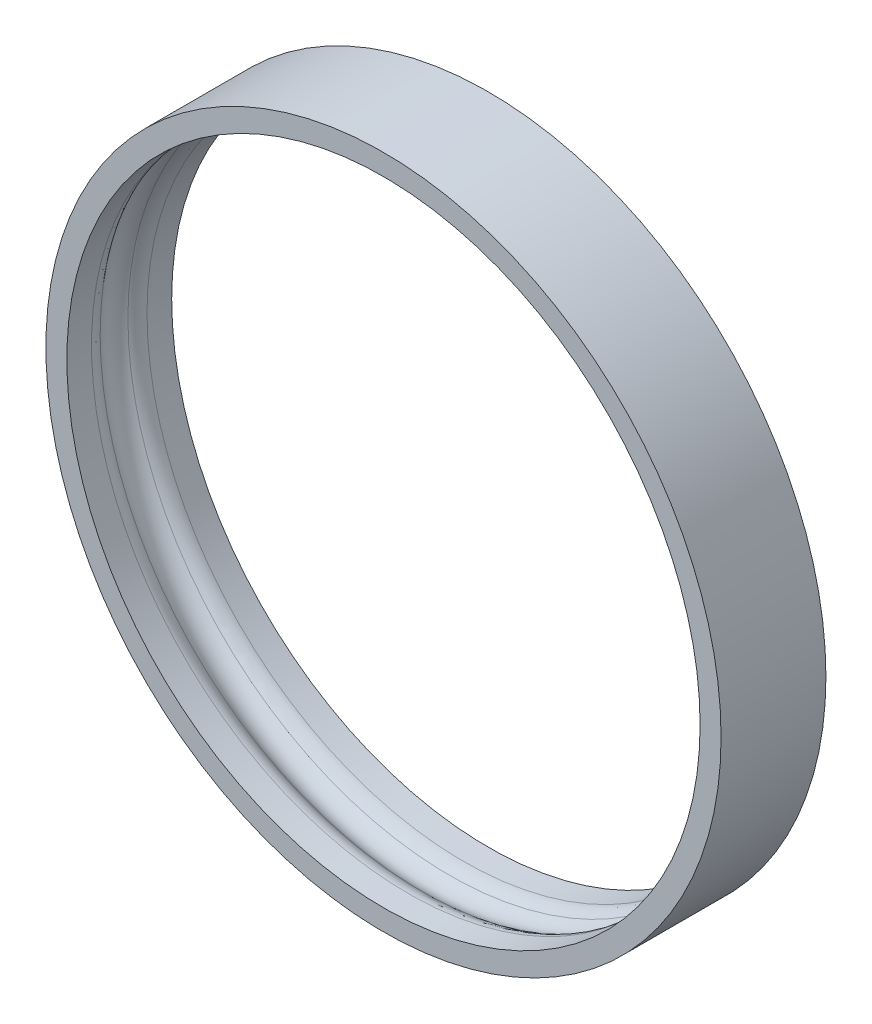
ISO-10303-21;
HEADER;
FILE_DESCRIPTION(('STEP AP214'),'2;1');
FILE_NAME('part.step','',(''),(''),'','','');
FILE_SCHEMA(('AUTOMOTIVE_DESIGN { 1 0 10303 214 1 1 1 1 }'));
ENDSEC;
DATA;
#1=APPLICATION_CONTEXT('core data for automotive mechanical design processes');
#2=APPLICATION_PROTOCOL_DEFINITION('international standard','automotive_design',2000,#1);
#3=PRODUCT_CONTEXT('',#1,'mechanical');
#4=PRODUCT('Part','Part','',(#3));
#5=PRODUCT_RELATED_PRODUCT_CATEGORY('part','',(#4));
#6=PRODUCT_DEFINITION_FORMATION('','',#4);
#7=PRODUCT_DEFINITION_CONTEXT('part definition',#1,'design');
#8=PRODUCT_DEFINITION('design','',#6,#7);
#9=PRODUCT_DEFINITION_SHAPE('','',#8);
#10=(LENGTH_UNIT() NAMED_UNIT(*) SI_UNIT(.MILLI.,.METRE.));
#11=(NAMED_UNIT(*) PLANE_ANGLE_UNIT() SI_UNIT($,.RADIAN.));
#12=(NAMED_UNIT(*) SI_UNIT($,.STERADIAN.) SOLID_ANGLE_UNIT());
#13=UNCERTAINTY_MEASURE_WITH_UNIT(LENGTH_MEASURE(1.E-05),#10,'distance_accuracy_value','');
#14=(GEOMETRIC_REPRESENTATION_CONTEXT(3) GLOBAL_UNCERTAINTY_ASSIGNED_CONTEXT((#13)) GLOBAL_UNIT_ASSIGNED_CONTEXT((#10,
#11,#12)) REPRESENTATION_CONTEXT('',''));
#15=CARTESIAN_POINT('',(0.,0.,0.));
#16=DIRECTION('',(0.,0.,1.));
#17=DIRECTION('',(1.,0.,0.));
#18=AXIS2_PLACEMENT_3D('',#15,#16,#17);
#19=CARTESIAN_POINT('',(0.,0.,2.5));
#20=DIRECTION('',(0.,0.,-1.));
#21=DIRECTION('',(-1.,0.,0.));
#22=AXIS2_PLACEMENT_3D('',#19,#20,#21);
#23=CYLINDRICAL_SURFACE('',#22,15.1);
#24=CARTESIAN_POINT('',(0.,0.,1.32287565553229));
#25=DIRECTION('',(0.,0.,1.));
#26=DIRECTION('',(1.,0.,0.));
#27=AXIS2_PLACEMENT_3D('',#24,#25,#26);
#28=CIRCLE('',#27,15.1);
#29=CARTESIAN_POINT('',(15.1,0.,1.32287565553229));
#30=VERTEX_POINT('',#29);
#31=EDGE_CURVE('E51',#30,#30,#28,.F.);
#32=ORIENTED_EDGE('',*,*,#31,.T.);
#33=EDGE_LOOP('',(#32));
#34=FACE_BOUND('',#33,.T.);
#35=CARTESIAN_POINT('',(0.,0.,2.5));
#36=DIRECTION('',(0.,0.,1.));
#37=DIRECTION('',(1.,0.,0.));
#38=AXIS2_PLACEMENT_3D('',#35,#36,#37);
#39=CIRCLE('',#38,15.1);
#40=CARTESIAN_POINT('',(15.1,0.,2.5));
#41=VERTEX_POINT('',#40);
#42=EDGE_CURVE('E60',#41,#41,#39,.T.);
#43=ORIENTED_EDGE('',*,*,#42,.T.);
#44=EDGE_LOOP('',(#43));
#45=FACE_BOUND('',#44,.T.);
#46=ADVANCED_FACE('F36',(#34,#45),#23,.F.);
#47=CARTESIAN_POINT('',(0.,0.,-1.32287565553229));
#48=DIRECTION('',(0.,0.,-1.));
#49=DIRECTION('',(-1.,0.,0.));
#50=AXIS2_PLACEMENT_3D('',#47,#48,#49);
#51=CIRCLE('',#50,15.1);
#52=CARTESIAN_POINT('',(-15.1,0.,-1.32287565553229));
#53=VERTEX_POINT('',#52);
#54=EDGE_CURVE('E10',#53,#53,#51,.F.);
#55=ORIENTED_EDGE('',*,*,#54,.T.);
#56=EDGE_LOOP('',(#55));
#57=FACE_BOUND('',#56,.T.);
#58=CARTESIAN_POINT('',(0.,0.,-2.5));
#59=DIRECTION('',(0.,0.,1.));
#60=DIRECTION('',(1.,0.,0.));
#61=AXIS2_PLACEMENT_3D('',#58,#59,#60);
#62=CIRCLE('',#61,15.1);
#63=CARTESIAN_POINT('',(15.1,0.,-2.5));
#64=VERTEX_POINT('',#63);
#65=EDGE_CURVE('E63',#64,#64,#62,.T.);
#66=ORIENTED_EDGE('',*,*,#65,.F.);
#67=EDGE_LOOP('',(#66));
#68=FACE_BOUND('',#67,.T.);
#69=ADVANCED_FACE('F73',(#57,#68),#23,.F.);
#70=CARTESIAN_POINT('',(0.,0.,2.5));
#71=DIRECTION('',(0.,0.,1.));
#72=DIRECTION('',(1.,0.,0.));
#73=AXIS2_PLACEMENT_3D('',#70,#71,#72);
#74=PLANE('',#73);
#75=CARTESIAN_POINT('',(0.,0.,2.5));
#76=DIRECTION('',(0.,0.,1.));
#77=DIRECTION('',(1.,0.,0.));
#78=AXIS2_PLACEMENT_3D('',#75,#76,#77);
#79=CIRCLE('',#78,16.1);
#80=CARTESIAN_POINT('',(16.1,0.,2.5));
#81=VERTEX_POINT('',#80);
#82=EDGE_CURVE('E56',#81,#81,#79,.T.);
#83=ORIENTED_EDGE('',*,*,#82,.T.);
#84=EDGE_LOOP('',(#83));
#85=FACE_BOUND('',#84,.T.);
#86=ORIENTED_EDGE('',*,*,#42,.F.);
#87=EDGE_LOOP('',(#86));
#88=FACE_BOUND('',#87,.T.);
#89=ADVANCED_FACE('F70',(#85,#88),#74,.T.);
#90=CARTESIAN_POINT('',(0.,0.,-2.5));
#91=DIRECTION('',(0.,0.,1.));
#92=DIRECTION('',(1.,0.,0.));
#93=AXIS2_PLACEMENT_3D('',#90,#91,#92);
#94=PLANE('',#93);
#95=CARTESIAN_POINT('',(0.,0.,-2.5));
#96=DIRECTION('',(0.,0.,1.));
#97=DIRECTION('',(1.,0.,0.));
#98=AXIS2_PLACEMENT_3D('',#95,#96,#97);
#99=CIRCLE('',#98,16.1);
#100=CARTESIAN_POINT('',(16.1,0.,-2.5));
#101=VERTEX_POINT('',#100);
#102=EDGE_CURVE('E57',#101,#101,#99,.T.);
#103=ORIENTED_EDGE('',*,*,#102,.F.);
#104=EDGE_LOOP('',(#103));
#105=FACE_BOUND('',#104,.T.);
#106=ORIENTED_EDGE('',*,*,#65,.T.);
#107=EDGE_LOOP('',(#106));
#108=FACE_BOUND('',#107,.T.);
#109=ADVANCED_FACE('F72',(#105,#108),#94,.F.);
#110=CARTESIAN_POINT('',(0.,0.,2.5));
#111=DIRECTION('',(0.,0.,-1.));
#112=DIRECTION('',(-1.,0.,0.));
#113=AXIS2_PLACEMENT_3D('',#110,#111,#112);
#114=CYLINDRICAL_SURFACE('',#113,16.1);
#115=ORIENTED_EDGE('',*,*,#82,.F.);
#116=EDGE_LOOP('',(#115));
#117=FACE_BOUND('',#116,.T.);
#118=ORIENTED_EDGE('',*,*,#102,.T.);
#119=EDGE_LOOP('',(#118));
#120=FACE_BOUND('',#119,.T.);
#121=ADVANCED_FACE('F80',(#117,#120),#114,.T.);
#122=CARTESIAN_POINT('',(0.,0.,0.));
#123=DIRECTION('',(0.,0.,1.));
#124=DIRECTION('',(1.,0.,0.));
#125=AXIS2_PLACEMENT_3D('',#122,#123,#124);
#126=TOROIDAL_SURFACE('',#125,14.6,1.);
#127=CARTESIAN_POINT('',(0.,0.,0.661437827766145));
#128=DIRECTION('',(0.,0.,-1.));
#129=DIRECTION('',(-1.,0.,0.));
#130=AXIS2_PLACEMENT_3D('',#127,#128,#129);
#131=CIRCLE('',#130,15.35);
#132=CARTESIAN_POINT('',(-15.35,0.,0.661437827766145));
#133=VERTEX_POINT('',#132);
#134=EDGE_CURVE('E43',#133,#133,#131,.F.);
#135=ORIENTED_EDGE('',*,*,#134,.T.);
#136=EDGE_LOOP('',(#135));
#137=FACE_BOUND('',#136,.T.);
#138=CARTESIAN_POINT('',(0.,0.,-0.661437827766145));
#139=DIRECTION('',(0.,0.,1.));
#140=DIRECTION('',(1.,0.,0.));
#141=AXIS2_PLACEMENT_3D('',#138,#139,#140);
#142=CIRCLE('',#141,15.35);
#143=CARTESIAN_POINT('',(15.35,0.,-0.661437827766145));
#144=VERTEX_POINT('',#143);
#145=EDGE_CURVE('E47',#144,#144,#142,.F.);
#146=ORIENTED_EDGE('',*,*,#145,.T.);
#147=EDGE_LOOP('',(#146));
#148=FACE_BOUND('',#147,.T.);
#149=ADVANCED_FACE('F89',(#137,#148),#126,.F.);
#150=CARTESIAN_POINT('',(0.,0.,1.32287565553229));
#151=DIRECTION('',(0.,0.,1.));
#152=DIRECTION('',(1.,0.,0.));
#153=AXIS2_PLACEMENT_3D('',#150,#151,#152);
#154=TOROIDAL_SURFACE('',#153,16.1,1.);
#155=ORIENTED_EDGE('',*,*,#134,.F.);
#156=EDGE_LOOP('',(#155));
#157=FACE_BOUND('',#156,.T.);
#158=ORIENTED_EDGE('',*,*,#31,.F.);
#159=EDGE_LOOP('',(#158));
#160=FACE_BOUND('',#159,.T.);
#161=ADVANCED_FACE('F91',(#157,#160),#154,.T.);
#162=CARTESIAN_POINT('',(0.,0.,-1.32287565553229));
#163=DIRECTION('',(0.,0.,-1.));
#164=DIRECTION('',(-1.,0.,0.));
#165=AXIS2_PLACEMENT_3D('',#162,#163,#164);
#166=TOROIDAL_SURFACE('',#165,16.1,1.);
#167=ORIENTED_EDGE('',*,*,#145,.F.);
#168=EDGE_LOOP('',(#167));
#169=FACE_BOUND('',#168,.T.);
#170=ORIENTED_EDGE('',*,*,#54,.F.);
#171=EDGE_LOOP('',(#170));
#172=FACE_BOUND('',#171,.T.);
#173=ADVANCED_FACE('F38',(#169,#172),#166,.T.);
#174=CLOSED_SHELL('',(#46,#69,#89,#109,#121,#149,#161,#173));
#175=MANIFOLD_SOLID_BREP('B2',#174);
#176=ADVANCED_BREP_SHAPE_REPRESENTATION('',(#18,#175),#14);
#177=SHAPE_DEFINITION_REPRESENTATION(#9,#176);
ENDSEC;
END-ISO-10303-21;
